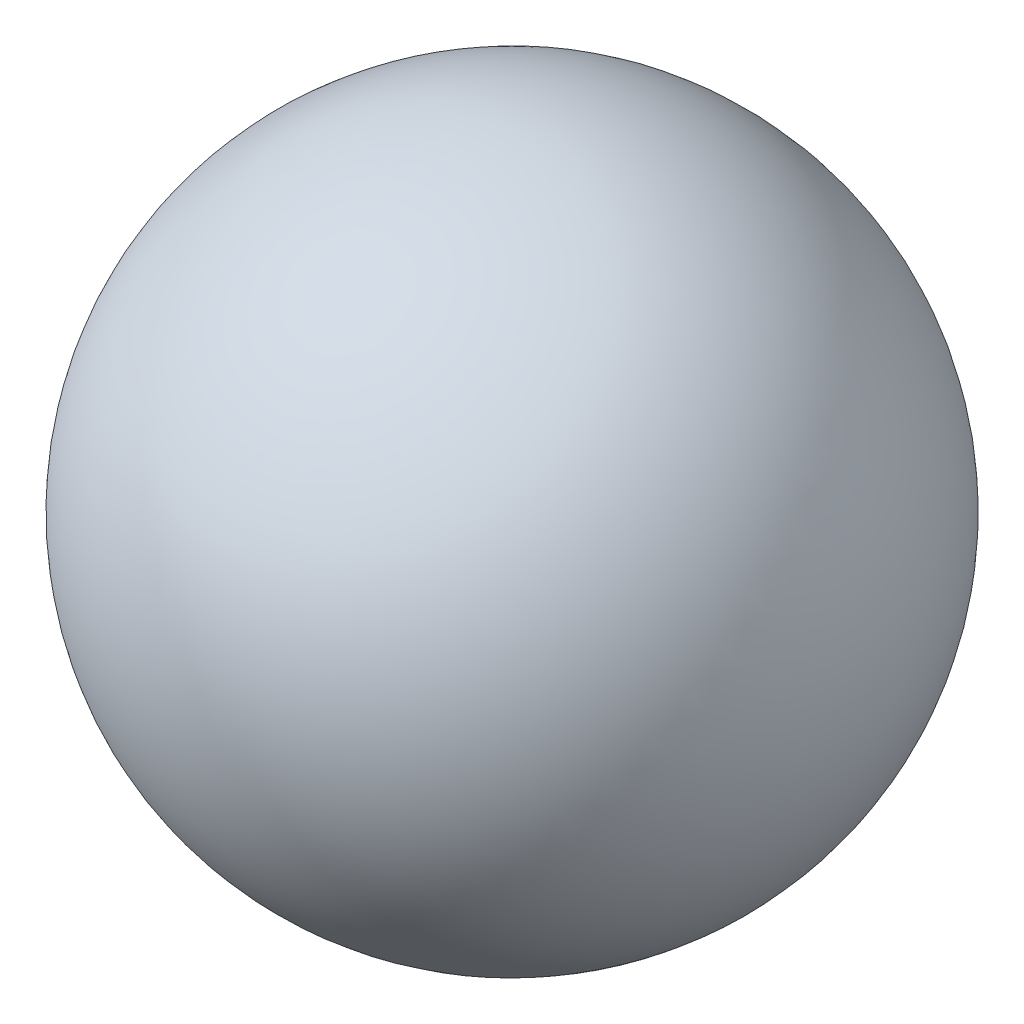
ISO-10303-21;
HEADER;
FILE_DESCRIPTION(('STEP AP214'),'2;1');
FILE_NAME('part.step','',(''),(''),'','','');
FILE_SCHEMA(('AUTOMOTIVE_DESIGN { 1 0 10303 214 1 1 1 1 }'));
ENDSEC;
DATA;
#1=APPLICATION_CONTEXT('core data for automotive mechanical design processes');
#2=APPLICATION_PROTOCOL_DEFINITION('international standard','automotive_design',2000,#1);
#3=PRODUCT_CONTEXT('',#1,'mechanical');
#4=PRODUCT('Part','Part','',(#3));
#5=PRODUCT_RELATED_PRODUCT_CATEGORY('part','',(#4));
#6=PRODUCT_DEFINITION_FORMATION('','',#4);
#7=PRODUCT_DEFINITION_CONTEXT('part definition',#1,'design');
#8=PRODUCT_DEFINITION('design','',#6,#7);
#9=PRODUCT_DEFINITION_SHAPE('','',#8);
#10=(LENGTH_UNIT() NAMED_UNIT(*) SI_UNIT(.MILLI.,.METRE.));
#11=(NAMED_UNIT(*) PLANE_ANGLE_UNIT() SI_UNIT($,.RADIAN.));
#12=(NAMED_UNIT(*) SI_UNIT($,.STERADIAN.) SOLID_ANGLE_UNIT());
#13=UNCERTAINTY_MEASURE_WITH_UNIT(LENGTH_MEASURE(1.E-05),#10,'distance_accuracy_value','');
#14=(GEOMETRIC_REPRESENTATION_CONTEXT(3) GLOBAL_UNCERTAINTY_ASSIGNED_CONTEXT((#13)) GLOBAL_UNIT_ASSIGNED_CONTEXT((#10,
#11,#12)) REPRESENTATION_CONTEXT('',''));
#15=CARTESIAN_POINT('',(0.,0.,0.));
#16=DIRECTION('',(0.,0.,1.));
#17=DIRECTION('',(1.,0.,0.));
#18=AXIS2_PLACEMENT_3D('',#15,#16,#17);
#19=CARTESIAN_POINT('',(64.16,-67.8060174553842,-14.7086602326703));
#20=DIRECTION('',(0.,-0.977271341040084,-0.211992278118133));
#21=DIRECTION('',(0.173648177666934,0.208771639069458,-0.962424393452912));
#22=AXIS2_PLACEMENT_3D('',#19,#20,#21);
#23=SPHERICAL_SURFACE('',#22,7.15);
#24=CARTESIAN_POINT('',(64.16,-60.8185273669476,-13.1929154441257));
#25=VERTEX_POINT('',#24);
#26=VERTEX_LOOP('',#25);
#27=FACE_BOUND('',#26,.T.);
#28=CARTESIAN_POINT('',(64.16,-74.7935075438208,-16.224405021215));
#29=VERTEX_POINT('',#28);
#30=VERTEX_LOOP('',#29);
#31=FACE_BOUND('',#30,.T.);
#32=ADVANCED_FACE('F16',(#27,#31),#23,.T.);
#33=CLOSED_SHELL('',(#32));
#34=MANIFOLD_SOLID_BREP('B1',#33);
#35=ADVANCED_BREP_SHAPE_REPRESENTATION('',(#18,#34),#14);
#36=SHAPE_DEFINITION_REPRESENTATION(#9,#35);
ENDSEC;
END-ISO-10303-21;
